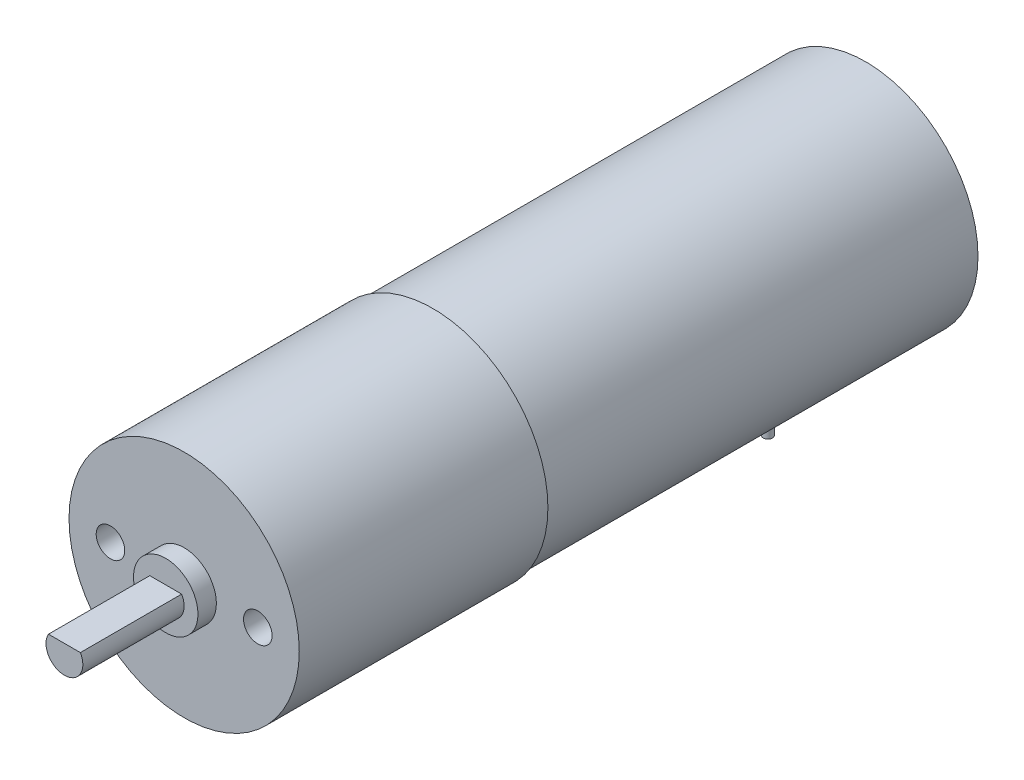
ISO-10303-21;
HEADER;
FILE_DESCRIPTION(('STEP AP214'),'2;1');
FILE_NAME('part.step','',(''),(''),'','','');
FILE_SCHEMA(('AUTOMOTIVE_DESIGN { 1 0 10303 214 1 1 1 1 }'));
ENDSEC;
DATA;
#1=APPLICATION_CONTEXT('core data for automotive mechanical design processes');
#2=APPLICATION_PROTOCOL_DEFINITION('international standard','automotive_design',2000,#1);
#3=PRODUCT_CONTEXT('',#1,'mechanical');
#4=PRODUCT('Part','Part','',(#3));
#5=PRODUCT_RELATED_PRODUCT_CATEGORY('part','',(#4));
#6=PRODUCT_DEFINITION_FORMATION('','',#4);
#7=PRODUCT_DEFINITION_CONTEXT('part definition',#1,'design');
#8=PRODUCT_DEFINITION('design','',#6,#7);
#9=PRODUCT_DEFINITION_SHAPE('','',#8);
#10=(LENGTH_UNIT() NAMED_UNIT(*) SI_UNIT(.MILLI.,.METRE.));
#11=(NAMED_UNIT(*) PLANE_ANGLE_UNIT() SI_UNIT($,.RADIAN.));
#12=(NAMED_UNIT(*) SI_UNIT($,.STERADIAN.) SOLID_ANGLE_UNIT());
#13=UNCERTAINTY_MEASURE_WITH_UNIT(LENGTH_MEASURE(1.E-05),#10,'distance_accuracy_value','');
#14=(GEOMETRIC_REPRESENTATION_CONTEXT(3) GLOBAL_UNCERTAINTY_ASSIGNED_CONTEXT((#13)) GLOBAL_UNIT_ASSIGNED_CONTEXT((#10,
#11,#12)) REPRESENTATION_CONTEXT('',''));
#15=CARTESIAN_POINT('',(0.,0.,0.));
#16=DIRECTION('',(0.,0.,1.));
#17=DIRECTION('',(1.,0.,0.));
#18=AXIS2_PLACEMENT_3D('',#15,#16,#17);
#19=CARTESIAN_POINT('',(-6.5,-15.,15.));
#20=DIRECTION('',(0.,0.,1.));
#21=DIRECTION('',(1.,0.,0.));
#22=AXIS2_PLACEMENT_3D('',#19,#20,#21);
#23=PLANE('',#22);
#24=DIRECTION('',(0.,1.,0.));
#25=VECTOR('',#24,1.);
#26=CARTESIAN_POINT('',(-6.5,-15.,15.));
#27=LINE('',#26,#25);
#28=CARTESIAN_POINT('',(-6.5,-10.3242433136768,15.));
#29=VERTEX_POINT('',#28);
#30=CARTESIAN_POINT('',(-6.5,0.,15.));
#31=VERTEX_POINT('',#30);
#32=EDGE_CURVE('E142',#29,#31,#27,.T.);
#33=ORIENTED_EDGE('',*,*,#32,.T.);
#34=DIRECTION('',(1.,0.,0.));
#35=VECTOR('',#34,1.);
#36=CARTESIAN_POINT('',(-6.5,0.,15.));
#37=LINE('',#36,#35);
#38=CARTESIAN_POINT('',(6.5,0.,15.));
#39=VERTEX_POINT('',#38);
#40=EDGE_CURVE('E137',#31,#39,#37,.T.);
#41=ORIENTED_EDGE('',*,*,#40,.T.);
#42=DIRECTION('',(0.,1.,0.));
#43=VECTOR('',#42,1.);
#44=CARTESIAN_POINT('',(6.5,-15.,15.));
#45=LINE('',#44,#43);
#46=CARTESIAN_POINT('',(6.49999999999999,-10.3242433136768,15.));
#47=VERTEX_POINT('',#46);
#48=EDGE_CURVE('E131',#47,#39,#45,.T.);
#49=ORIENTED_EDGE('',*,*,#48,.F.);
#50=CARTESIAN_POINT('',(0.,0.,15.));
#51=DIRECTION('',(0.,0.,1.));
#52=DIRECTION('',(1.,0.,0.));
#53=AXIS2_PLACEMENT_3D('',#50,#51,#52);
#54=CIRCLE('',#53,12.2);
#55=EDGE_CURVE('E134',#29,#47,#54,.T.);
#56=ORIENTED_EDGE('',*,*,#55,.F.);
#57=EDGE_LOOP('',(#33,#41,#49,#56));
#58=FACE_BOUND('',#57,.T.);
#59=DIRECTION('',(0.,-1.,0.));
#60=VECTOR('',#59,1.);
#61=CARTESIAN_POINT('',(-4.12758101808042,-15.,15.));
#62=LINE('',#61,#60);
#63=CARTESIAN_POINT('',(-4.12758101808042,-10.5,15.));
#64=VERTEX_POINT('',#63);
#65=CARTESIAN_POINT('',(-4.12758101808042,-7.5,15.));
#66=VERTEX_POINT('',#65);
#67=EDGE_CURVE('E75',#64,#66,#62,.F.);
#68=ORIENTED_EDGE('',*,*,#67,.F.);
#69=DIRECTION('',(-1.,0.,0.));
#70=VECTOR('',#69,1.);
#71=CARTESIAN_POINT('',(4.09114064073439,-10.5,15.));
#72=LINE('',#71,#70);
#73=CARTESIAN_POINT('',(4.3098622995492,-10.5,15.));
#74=VERTEX_POINT('',#73);
#75=EDGE_CURVE('E182',#74,#64,#72,.T.);
#76=ORIENTED_EDGE('',*,*,#75,.F.);
#77=DIRECTION('',(0.,1.,0.));
#78=VECTOR('',#77,1.);
#79=CARTESIAN_POINT('',(4.3098622995492,-15.,15.));
#80=LINE('',#79,#78);
#81=CARTESIAN_POINT('',(4.3098622995492,-7.5,15.));
#82=VERTEX_POINT('',#81);
#83=EDGE_CURVE('E67',#82,#74,#80,.F.);
#84=ORIENTED_EDGE('',*,*,#83,.F.);
#85=DIRECTION('',(1.,0.,0.));
#86=VECTOR('',#85,1.);
#87=CARTESIAN_POINT('',(4.09114064073439,-7.5,15.));
#88=LINE('',#87,#86);
#89=EDGE_CURVE('E61',#66,#82,#88,.T.);
#90=ORIENTED_EDGE('',*,*,#89,.F.);
#91=EDGE_LOOP('',(#68,#76,#84,#90));
#92=FACE_BOUND('',#91,.T.);
#93=ADVANCED_FACE('F44',(#58,#92),#23,.F.);
#94=CARTESIAN_POINT('',(0.,0.,47.));
#95=DIRECTION('',(0.,0.,-1.));
#96=DIRECTION('',(-1.,0.,0.));
#97=AXIS2_PLACEMENT_3D('',#94,#95,#96);
#98=CYLINDRICAL_SURFACE('',#97,12.2);
#99=CARTESIAN_POINT('',(0.,0.,10.));
#100=DIRECTION('',(0.,0.,-1.));
#101=DIRECTION('',(-1.,0.,0.));
#102=AXIS2_PLACEMENT_3D('',#99,#100,#101);
#103=CIRCLE('',#102,12.2);
#104=CARTESIAN_POINT('',(6.5,-10.3242433136768,10.));
#105=VERTEX_POINT('',#104);
#106=CARTESIAN_POINT('',(-6.5,-10.3242433136768,10.));
#107=VERTEX_POINT('',#106);
#108=EDGE_CURVE('E150',#105,#107,#103,.T.);
#109=ORIENTED_EDGE('',*,*,#108,.T.);
#110=DIRECTION('',(0.,0.,-1.));
#111=VECTOR('',#110,1.);
#112=CARTESIAN_POINT('',(-6.50000000000001,-10.3242433136768,47.));
#113=LINE('',#112,#111);
#114=EDGE_CURVE('E155',#107,#29,#113,.F.);
#115=ORIENTED_EDGE('',*,*,#114,.T.);
#116=ORIENTED_EDGE('',*,*,#55,.T.);
#117=DIRECTION('',(0.,0.,-1.));
#118=VECTOR('',#117,1.);
#119=CARTESIAN_POINT('',(6.49999999999999,-10.3242433136768,47.));
#120=LINE('',#119,#118);
#121=EDGE_CURVE('E146',#47,#105,#120,.T.);
#122=ORIENTED_EDGE('',*,*,#121,.T.);
#123=EDGE_LOOP('',(#109,#115,#116,#122));
#124=FACE_BOUND('',#123,.T.);
#125=CARTESIAN_POINT('',(0.,0.,47.));
#126=DIRECTION('',(0.,0.,1.));
#127=DIRECTION('',(1.,0.,0.));
#128=AXIS2_PLACEMENT_3D('',#125,#126,#127);
#129=CIRCLE('',#128,12.2);
#130=CARTESIAN_POINT('',(12.2,0.,47.));
#131=VERTEX_POINT('',#130);
#132=EDGE_CURVE('E159',#131,#131,#129,.T.);
#133=ORIENTED_EDGE('',*,*,#132,.F.);
#134=EDGE_LOOP('',(#133));
#135=FACE_BOUND('',#134,.T.);
#136=CARTESIAN_POINT('',(0.,0.,0.));
#137=DIRECTION('',(0.,0.,1.));
#138=DIRECTION('',(1.,0.,0.));
#139=AXIS2_PLACEMENT_3D('',#136,#137,#138);
#140=CIRCLE('',#139,12.2);
#141=CARTESIAN_POINT('',(12.2,0.,0.));
#142=VERTEX_POINT('',#141);
#143=EDGE_CURVE('E162',#142,#142,#140,.T.);
#144=ORIENTED_EDGE('',*,*,#143,.T.);
#145=EDGE_LOOP('',(#144));
#146=FACE_BOUND('',#145,.T.);
#147=ADVANCED_FACE('F153',(#124,#135,#146),#98,.T.);
#148=CARTESIAN_POINT('',(0.,0.,0.));
#149=DIRECTION('',(0.,0.,1.));
#150=DIRECTION('',(1.,0.,0.));
#151=AXIS2_PLACEMENT_3D('',#148,#149,#150);
#152=PLANE('',#151);
#153=ORIENTED_EDGE('',*,*,#143,.F.);
#154=EDGE_LOOP('',(#153));
#155=FACE_BOUND('',#154,.T.);
#156=ADVANCED_FACE('F248',(#155),#152,.F.);
#157=CARTESIAN_POINT('',(0.,0.,74.));
#158=DIRECTION('',(0.,0.,-1.));
#159=DIRECTION('',(-1.,0.,0.));
#160=AXIS2_PLACEMENT_3D('',#157,#158,#159);
#161=CYLINDRICAL_SURFACE('',#160,12.5);
#162=CARTESIAN_POINT('',(0.,0.,74.));
#163=DIRECTION('',(0.,0.,1.));
#164=DIRECTION('',(1.,0.,0.));
#165=AXIS2_PLACEMENT_3D('',#162,#163,#164);
#166=CIRCLE('',#165,12.5);
#167=CARTESIAN_POINT('',(12.5,0.,74.));
#168=VERTEX_POINT('',#167);
#169=EDGE_CURVE('E237',#168,#168,#166,.T.);
#170=ORIENTED_EDGE('',*,*,#169,.F.);
#171=EDGE_LOOP('',(#170));
#172=FACE_BOUND('',#171,.T.);
#173=CARTESIAN_POINT('',(0.,0.,47.));
#174=DIRECTION('',(0.,0.,1.));
#175=DIRECTION('',(1.,0.,0.));
#176=AXIS2_PLACEMENT_3D('',#173,#174,#175);
#177=CIRCLE('',#176,12.5);
#178=CARTESIAN_POINT('',(12.5,0.,47.));
#179=VERTEX_POINT('',#178);
#180=EDGE_CURVE('E235',#179,#179,#177,.T.);
#181=ORIENTED_EDGE('',*,*,#180,.T.);
#182=EDGE_LOOP('',(#181));
#183=FACE_BOUND('',#182,.T.);
#184=ADVANCED_FACE('F250',(#172,#183),#161,.T.);
#185=CARTESIAN_POINT('',(0.,0.,74.));
#186=DIRECTION('',(0.,0.,1.));
#187=DIRECTION('',(1.,0.,0.));
#188=AXIS2_PLACEMENT_3D('',#185,#186,#187);
#189=PLANE('',#188);
#190=CARTESIAN_POINT('',(-8.,0.,74.));
#191=DIRECTION('',(0.,0.,1.));
#192=DIRECTION('',(1.,0.,0.));
#193=AXIS2_PLACEMENT_3D('',#190,#191,#192);
#194=CIRCLE('',#193,1.55);
#195=CARTESIAN_POINT('',(-6.45,0.,74.));
#196=VERTEX_POINT('',#195);
#197=EDGE_CURVE('E566',#196,#196,#194,.T.);
#198=ORIENTED_EDGE('',*,*,#197,.F.);
#199=EDGE_LOOP('',(#198));
#200=FACE_BOUND('',#199,.T.);
#201=CARTESIAN_POINT('',(8.,0.,74.));
#202=DIRECTION('',(0.,0.,1.));
#203=DIRECTION('',(-1.,0.,0.));
#204=AXIS2_PLACEMENT_3D('',#201,#202,#203);
#205=CIRCLE('',#204,1.55);
#206=CARTESIAN_POINT('',(6.45,0.,74.));
#207=VERTEX_POINT('',#206);
#208=EDGE_CURVE('E563',#207,#207,#205,.T.);
#209=ORIENTED_EDGE('',*,*,#208,.F.);
#210=EDGE_LOOP('',(#209));
#211=FACE_BOUND('',#210,.T.);
#212=CARTESIAN_POINT('',(0.,0.,74.));
#213=DIRECTION('',(0.,0.,1.));
#214=DIRECTION('',(1.,0.,0.));
#215=AXIS2_PLACEMENT_3D('',#212,#213,#214);
#216=CIRCLE('',#215,3.5);
#217=CARTESIAN_POINT('',(3.5,0.,74.));
#218=VERTEX_POINT('',#217);
#219=EDGE_CURVE('E156',#218,#218,#216,.T.);
#220=ORIENTED_EDGE('',*,*,#219,.F.);
#221=EDGE_LOOP('',(#220));
#222=FACE_BOUND('',#221,.T.);
#223=ORIENTED_EDGE('',*,*,#169,.T.);
#224=EDGE_LOOP('',(#223));
#225=FACE_BOUND('',#224,.T.);
#226=ADVANCED_FACE('F255',(#200,#211,#222,#225),#189,.T.);
#227=CARTESIAN_POINT('',(0.,0.,47.));
#228=DIRECTION('',(0.,0.,1.));
#229=DIRECTION('',(1.,0.,0.));
#230=AXIS2_PLACEMENT_3D('',#227,#228,#229);
#231=PLANE('',#230);
#232=ORIENTED_EDGE('',*,*,#132,.T.);
#233=EDGE_LOOP('',(#232));
#234=FACE_BOUND('',#233,.T.);
#235=ORIENTED_EDGE('',*,*,#180,.F.);
#236=EDGE_LOOP('',(#235));
#237=FACE_BOUND('',#236,.T.);
#238=ADVANCED_FACE('F292',(#234,#237),#231,.F.);
#239=CARTESIAN_POINT('',(0.,0.,76.));
#240=DIRECTION('',(0.,0.,-1.));
#241=DIRECTION('',(-1.,0.,0.));
#242=AXIS2_PLACEMENT_3D('',#239,#240,#241);
#243=CYLINDRICAL_SURFACE('',#242,3.5);
#244=CARTESIAN_POINT('',(0.,0.,76.));
#245=DIRECTION('',(0.,0.,1.));
#246=DIRECTION('',(1.,0.,0.));
#247=AXIS2_PLACEMENT_3D('',#244,#245,#246);
#248=CIRCLE('',#247,3.5);
#249=CARTESIAN_POINT('',(3.5,0.,76.));
#250=VERTEX_POINT('',#249);
#251=EDGE_CURVE('E233',#250,#250,#248,.T.);
#252=ORIENTED_EDGE('',*,*,#251,.F.);
#253=EDGE_LOOP('',(#252));
#254=FACE_BOUND('',#253,.T.);
#255=ORIENTED_EDGE('',*,*,#219,.T.);
#256=EDGE_LOOP('',(#255));
#257=FACE_BOUND('',#256,.T.);
#258=ADVANCED_FACE('F289',(#254,#257),#243,.T.);
#259=CARTESIAN_POINT('',(0.,0.,76.));
#260=DIRECTION('',(0.,0.,1.));
#261=DIRECTION('',(1.,0.,0.));
#262=AXIS2_PLACEMENT_3D('',#259,#260,#261);
#263=PLANE('',#262);
#264=CARTESIAN_POINT('',(0.,0.,76.));
#265=DIRECTION('',(0.,0.,1.));
#266=DIRECTION('',(1.,0.,0.));
#267=AXIS2_PLACEMENT_3D('',#264,#265,#266);
#268=CIRCLE('',#267,2.);
#269=CARTESIAN_POINT('',(-1.73205080756888,1.,76.));
#270=VERTEX_POINT('',#269);
#271=CARTESIAN_POINT('',(1.73205080756888,1.,76.));
#272=VERTEX_POINT('',#271);
#273=EDGE_CURVE('E217',#270,#272,#268,.T.);
#274=ORIENTED_EDGE('',*,*,#273,.F.);
#275=DIRECTION('',(-1.,0.,0.));
#276=VECTOR('',#275,1.);
#277=CARTESIAN_POINT('',(-1.73205080756888,1.,76.));
#278=LINE('',#277,#276);
#279=EDGE_CURVE('E126',#272,#270,#278,.T.);
#280=ORIENTED_EDGE('',*,*,#279,.F.);
#281=EDGE_LOOP('',(#274,#280));
#282=FACE_BOUND('',#281,.T.);
#283=ORIENTED_EDGE('',*,*,#251,.T.);
#284=EDGE_LOOP('',(#283));
#285=FACE_BOUND('',#284,.T.);
#286=ADVANCED_FACE('F285',(#282,#285),#263,.T.);
#287=CARTESIAN_POINT('',(0.,0.,87.));
#288=DIRECTION('',(0.,0.,-1.));
#289=DIRECTION('',(-1.,0.,0.));
#290=AXIS2_PLACEMENT_3D('',#287,#288,#289);
#291=CYLINDRICAL_SURFACE('',#290,2.);
#292=ORIENTED_EDGE('',*,*,#273,.T.);
#293=DIRECTION('',(0.,0.,-1.));
#294=VECTOR('',#293,1.);
#295=CARTESIAN_POINT('',(1.73205080756888,1.,87.));
#296=LINE('',#295,#294);
#297=CARTESIAN_POINT('',(1.73205080756888,1.,87.));
#298=VERTEX_POINT('',#297);
#299=EDGE_CURVE('E231',#298,#272,#296,.T.);
#300=ORIENTED_EDGE('',*,*,#299,.F.);
#301=CARTESIAN_POINT('',(0.,0.,87.));
#302=DIRECTION('',(0.,0.,1.));
#303=DIRECTION('',(1.,0.,0.));
#304=AXIS2_PLACEMENT_3D('',#301,#302,#303);
#305=CIRCLE('',#304,2.);
#306=CARTESIAN_POINT('',(-1.73205080756888,1.,87.));
#307=VERTEX_POINT('',#306);
#308=EDGE_CURVE('E220',#307,#298,#305,.T.);
#309=ORIENTED_EDGE('',*,*,#308,.F.);
#310=DIRECTION('',(0.,0.,-1.));
#311=VECTOR('',#310,1.);
#312=CARTESIAN_POINT('',(-1.73205080756888,1.,87.));
#313=LINE('',#312,#311);
#314=EDGE_CURVE('E225',#307,#270,#313,.T.);
#315=ORIENTED_EDGE('',*,*,#314,.T.);
#316=EDGE_LOOP('',(#292,#300,#309,#315));
#317=FACE_BOUND('',#316,.T.);
#318=ADVANCED_FACE('F281',(#317),#291,.T.);
#319=CARTESIAN_POINT('',(-1.73205080756888,1.,87.));
#320=DIRECTION('',(0.,-1.,0.));
#321=DIRECTION('',(0.,0.,-1.));
#322=AXIS2_PLACEMENT_3D('',#319,#320,#321);
#323=PLANE('',#322);
#324=ORIENTED_EDGE('',*,*,#279,.T.);
#325=ORIENTED_EDGE('',*,*,#314,.F.);
#326=DIRECTION('',(-1.,0.,0.));
#327=VECTOR('',#326,1.);
#328=CARTESIAN_POINT('',(-1.73205080756888,1.,87.));
#329=LINE('',#328,#327);
#330=EDGE_CURVE('E223',#298,#307,#329,.T.);
#331=ORIENTED_EDGE('',*,*,#330,.F.);
#332=ORIENTED_EDGE('',*,*,#299,.T.);
#333=EDGE_LOOP('',(#324,#325,#331,#332));
#334=FACE_BOUND('',#333,.T.);
#335=ADVANCED_FACE('F277',(#334),#323,.F.);
#336=CARTESIAN_POINT('',(0.,0.,87.));
#337=DIRECTION('',(0.,0.,1.));
#338=DIRECTION('',(1.,0.,0.));
#339=AXIS2_PLACEMENT_3D('',#336,#337,#338);
#340=PLANE('',#339);
#341=ORIENTED_EDGE('',*,*,#308,.T.);
#342=ORIENTED_EDGE('',*,*,#330,.T.);
#343=EDGE_LOOP('',(#341,#342));
#344=FACE_BOUND('',#343,.T.);
#345=ADVANCED_FACE('F273',(#344),#340,.T.);
#346=CARTESIAN_POINT('',(-6.5,-15.,15.));
#347=DIRECTION('',(-1.,0.,0.));
#348=DIRECTION('',(0.,0.,1.));
#349=AXIS2_PLACEMENT_3D('',#346,#347,#348);
#350=PLANE('',#349);
#351=DIRECTION('',(0.,1.,0.));
#352=VECTOR('',#351,1.);
#353=CARTESIAN_POINT('',(-6.5,-15.,10.));
#354=LINE('',#353,#352);
#355=CARTESIAN_POINT('',(-6.5,0.,10.));
#356=VERTEX_POINT('',#355);
#357=EDGE_CURVE('E215',#107,#356,#354,.T.);
#358=ORIENTED_EDGE('',*,*,#357,.T.);
#359=DIRECTION('',(0.,0.,1.));
#360=VECTOR('',#359,1.);
#361=CARTESIAN_POINT('',(-6.5,0.,15.));
#362=LINE('',#361,#360);
#363=EDGE_CURVE('E206',#356,#31,#362,.T.);
#364=ORIENTED_EDGE('',*,*,#363,.T.);
#365=ORIENTED_EDGE('',*,*,#32,.F.);
#366=ORIENTED_EDGE('',*,*,#114,.F.);
#367=EDGE_LOOP('',(#358,#364,#365,#366));
#368=FACE_BOUND('',#367,.T.);
#369=ADVANCED_FACE('F269',(#368),#350,.F.);
#370=CARTESIAN_POINT('',(-6.5,-15.,10.));
#371=DIRECTION('',(0.,0.,-1.));
#372=DIRECTION('',(-1.,0.,0.));
#373=AXIS2_PLACEMENT_3D('',#370,#371,#372);
#374=PLANE('',#373);
#375=DIRECTION('',(0.,1.,0.));
#376=VECTOR('',#375,1.);
#377=CARTESIAN_POINT('',(6.5,-15.,10.));
#378=LINE('',#377,#376);
#379=CARTESIAN_POINT('',(6.5,0.,10.));
#380=VERTEX_POINT('',#379);
#381=EDGE_CURVE('E141',#105,#380,#378,.T.);
#382=ORIENTED_EDGE('',*,*,#381,.T.);
#383=DIRECTION('',(-1.,0.,0.));
#384=VECTOR('',#383,1.);
#385=CARTESIAN_POINT('',(-6.5,0.,10.));
#386=LINE('',#385,#384);
#387=EDGE_CURVE('E212',#380,#356,#386,.T.);
#388=ORIENTED_EDGE('',*,*,#387,.T.);
#389=ORIENTED_EDGE('',*,*,#357,.F.);
#390=ORIENTED_EDGE('',*,*,#108,.F.);
#391=EDGE_LOOP('',(#382,#388,#389,#390));
#392=FACE_BOUND('',#391,.T.);
#393=ADVANCED_FACE('F272',(#392),#374,.F.);
#394=CARTESIAN_POINT('',(6.5,-15.,15.));
#395=DIRECTION('',(1.,0.,0.));
#396=DIRECTION('',(0.,0.,-1.));
#397=AXIS2_PLACEMENT_3D('',#394,#395,#396);
#398=PLANE('',#397);
#399=ORIENTED_EDGE('',*,*,#48,.T.);
#400=DIRECTION('',(0.,0.,-1.));
#401=VECTOR('',#400,1.);
#402=CARTESIAN_POINT('',(6.5,0.,15.));
#403=LINE('',#402,#401);
#404=EDGE_CURVE('E210',#39,#380,#403,.T.);
#405=ORIENTED_EDGE('',*,*,#404,.T.);
#406=ORIENTED_EDGE('',*,*,#381,.F.);
#407=ORIENTED_EDGE('',*,*,#121,.F.);
#408=EDGE_LOOP('',(#399,#405,#406,#407));
#409=FACE_BOUND('',#408,.T.);
#410=ADVANCED_FACE('F147',(#409),#398,.F.);
#411=CARTESIAN_POINT('',(0.,0.,0.));
#412=DIRECTION('',(0.,-1.,0.));
#413=DIRECTION('',(0.,0.,-1.));
#414=AXIS2_PLACEMENT_3D('',#411,#412,#413);
#415=PLANE('',#414);
#416=ORIENTED_EDGE('',*,*,#363,.F.);
#417=ORIENTED_EDGE('',*,*,#387,.F.);
#418=ORIENTED_EDGE('',*,*,#404,.F.);
#419=ORIENTED_EDGE('',*,*,#40,.F.);
#420=EDGE_LOOP('',(#416,#417,#418,#419));
#421=FACE_BOUND('',#420,.T.);
#422=ADVANCED_FACE('F355',(#421),#415,.T.);
#423=CARTESIAN_POINT('',(-3.90885935926561,-10.5,12.5));
#424=DIRECTION('',(-0.996194698091746,0.,-0.0871557427476584));
#425=DIRECTION('',(-0.0871557427476584,0.,0.996194698091746));
#426=AXIS2_PLACEMENT_3D('',#423,#424,#425);
#427=PLANE('',#426);
#428=ORIENTED_EDGE('',*,*,#67,.T.);
#429=DIRECTION('',(0.0871557427476584,0.,-0.996194698091746));
#430=VECTOR('',#429,1.);
#431=CARTESIAN_POINT('',(-3.84809037131444,-7.5,11.8054072893323));
#432=LINE('',#431,#430);
#433=CARTESIAN_POINT('',(-3.90885935926561,-7.5,12.5));
#434=VERTEX_POINT('',#433);
#435=EDGE_CURVE('E48',#434,#66,#432,.F.);
#436=ORIENTED_EDGE('',*,*,#435,.F.);
#437=DIRECTION('',(0.,1.,0.));
#438=VECTOR('',#437,1.);
#439=CARTESIAN_POINT('',(-3.90885935926561,-10.5,12.5));
#440=LINE('',#439,#438);
#441=CARTESIAN_POINT('',(-3.90885935926561,-10.5,12.5));
#442=VERTEX_POINT('',#441);
#443=EDGE_CURVE('E205',#442,#434,#440,.T.);
#444=ORIENTED_EDGE('',*,*,#443,.F.);
#445=DIRECTION('',(0.0871557427476584,0.,-0.996194698091746));
#446=VECTOR('',#445,1.);
#447=CARTESIAN_POINT('',(-3.90885935926561,-10.5,12.5));
#448=LINE('',#447,#446);
#449=EDGE_CURVE('E189',#442,#64,#448,.F.);
#450=ORIENTED_EDGE('',*,*,#449,.T.);
#451=EDGE_LOOP('',(#428,#436,#444,#450));
#452=FACE_BOUND('',#451,.T.);
#453=ADVANCED_FACE('F46',(#452),#427,.T.);
#454=CARTESIAN_POINT('',(4.09114064073439,-7.5,12.5));
#455=DIRECTION('',(0.,-1.,0.));
#456=DIRECTION('',(1.,0.,0.));
#457=AXIS2_PLACEMENT_3D('',#454,#455,#456);
#458=PLANE('',#457);
#459=ORIENTED_EDGE('',*,*,#89,.T.);
#460=DIRECTION('',(-0.0871557427476584,0.,-0.996194698091746));
#461=VECTOR('',#460,1.);
#462=CARTESIAN_POINT('',(4.09114064073439,-7.5,12.5));
#463=LINE('',#462,#461);
#464=CARTESIAN_POINT('',(4.09114064073439,-7.5,12.5));
#465=VERTEX_POINT('',#464);
#466=EDGE_CURVE('E183',#465,#82,#463,.F.);
#467=ORIENTED_EDGE('',*,*,#466,.F.);
#468=DIRECTION('',(1.,0.,0.));
#469=VECTOR('',#468,1.);
#470=CARTESIAN_POINT('',(4.09114064073439,-7.5,12.5));
#471=LINE('',#470,#469);
#472=EDGE_CURVE('E83',#434,#465,#471,.T.);
#473=ORIENTED_EDGE('',*,*,#472,.F.);
#474=ORIENTED_EDGE('',*,*,#435,.T.);
#475=EDGE_LOOP('',(#459,#467,#473,#474));
#476=FACE_BOUND('',#475,.T.);
#477=ADVANCED_FACE('F531',(#476),#458,.F.);
#478=CARTESIAN_POINT('',(4.09114064073439,-10.5,12.5));
#479=DIRECTION('',(0.996194698091746,0.,-0.0871557427476584));
#480=DIRECTION('',(-0.0871557427476584,0.,-0.996194698091746));
#481=AXIS2_PLACEMENT_3D('',#478,#479,#480);
#482=PLANE('',#481);
#483=ORIENTED_EDGE('',*,*,#83,.T.);
#484=DIRECTION('',(-0.0871557427476584,0.,-0.996194698091746));
#485=VECTOR('',#484,1.);
#486=CARTESIAN_POINT('',(4.09114064073439,-10.5,12.5));
#487=LINE('',#486,#485);
#488=CARTESIAN_POINT('',(4.09114064073439,-10.5,12.5));
#489=VERTEX_POINT('',#488);
#490=EDGE_CURVE('E186',#489,#74,#487,.F.);
#491=ORIENTED_EDGE('',*,*,#490,.F.);
#492=DIRECTION('',(0.,-1.,0.));
#493=VECTOR('',#492,1.);
#494=CARTESIAN_POINT('',(4.09114064073439,-10.5,12.5));
#495=LINE('',#494,#493);
#496=EDGE_CURVE('E196',#465,#489,#495,.T.);
#497=ORIENTED_EDGE('',*,*,#496,.F.);
#498=ORIENTED_EDGE('',*,*,#466,.T.);
#499=EDGE_LOOP('',(#483,#491,#497,#498));
#500=FACE_BOUND('',#499,.T.);
#501=ADVANCED_FACE('F529',(#500),#482,.T.);
#502=CARTESIAN_POINT('',(4.09114064073439,-10.5,12.5));
#503=DIRECTION('',(0.,1.,0.));
#504=DIRECTION('',(0.,0.,1.));
#505=AXIS2_PLACEMENT_3D('',#502,#503,#504);
#506=PLANE('',#505);
#507=CARTESIAN_POINT('',(3.13671046240396,-10.5,13.75));
#508=DIRECTION('',(0.,1.,0.));
#509=DIRECTION('',(0.,0.,1.));
#510=AXIS2_PLACEMENT_3D('',#507,#508,#509);
#511=CIRCLE('',#510,0.5);
#512=CARTESIAN_POINT('',(3.13671046240396,-10.5,14.25));
#513=VERTEX_POINT('',#512);
#514=EDGE_CURVE('E11',#513,#513,#511,.F.);
#515=ORIENTED_EDGE('',*,*,#514,.F.);
#516=EDGE_LOOP('',(#515));
#517=FACE_BOUND('',#516,.T.);
#518=CARTESIAN_POINT('',(1.93671046240396,-10.5,13.75));
#519=DIRECTION('',(0.,1.,0.));
#520=DIRECTION('',(0.,0.,1.));
#521=AXIS2_PLACEMENT_3D('',#518,#519,#520);
#522=CIRCLE('',#521,0.5);
#523=CARTESIAN_POINT('',(1.93671046240396,-10.5,14.25));
#524=VERTEX_POINT('',#523);
#525=EDGE_CURVE('E53',#524,#524,#522,.F.);
#526=ORIENTED_EDGE('',*,*,#525,.F.);
#527=EDGE_LOOP('',(#526));
#528=FACE_BOUND('',#527,.T.);
#529=CARTESIAN_POINT('',(0.736710462403958,-10.5,13.75));
#530=DIRECTION('',(0.,1.,0.));
#531=DIRECTION('',(0.,0.,1.));
#532=AXIS2_PLACEMENT_3D('',#529,#530,#531);
#533=CIRCLE('',#532,0.5);
#534=CARTESIAN_POINT('',(0.736710462403958,-10.5,14.25));
#535=VERTEX_POINT('',#534);
#536=EDGE_CURVE('E176',#535,#535,#533,.F.);
#537=ORIENTED_EDGE('',*,*,#536,.F.);
#538=EDGE_LOOP('',(#537));
#539=FACE_BOUND('',#538,.T.);
#540=CARTESIAN_POINT('',(-0.463289537596042,-10.5,13.75));
#541=DIRECTION('',(0.,1.,0.));
#542=DIRECTION('',(0.,0.,1.));
#543=AXIS2_PLACEMENT_3D('',#540,#541,#542);
#544=CIRCLE('',#543,0.5);
#545=CARTESIAN_POINT('',(-0.463289537596042,-10.5,14.25));
#546=VERTEX_POINT('',#545);
#547=EDGE_CURVE('E173',#546,#546,#544,.F.);
#548=ORIENTED_EDGE('',*,*,#547,.F.);
#549=EDGE_LOOP('',(#548));
#550=FACE_BOUND('',#549,.T.);
#551=CARTESIAN_POINT('',(-1.66328953759604,-10.5,13.75));
#552=DIRECTION('',(0.,1.,0.));
#553=DIRECTION('',(0.,0.,1.));
#554=AXIS2_PLACEMENT_3D('',#551,#552,#553);
#555=CIRCLE('',#554,0.5);
#556=CARTESIAN_POINT('',(-1.66328953759604,-10.5,14.25));
#557=VERTEX_POINT('',#556);
#558=EDGE_CURVE('E170',#557,#557,#555,.F.);
#559=ORIENTED_EDGE('',*,*,#558,.F.);
#560=EDGE_LOOP('',(#559));
#561=FACE_BOUND('',#560,.T.);
#562=CARTESIAN_POINT('',(-2.86328953759604,-10.5,13.75));
#563=DIRECTION('',(0.,1.,0.));
#564=DIRECTION('',(0.,0.,1.));
#565=AXIS2_PLACEMENT_3D('',#562,#563,#564);
#566=CIRCLE('',#565,0.5);
#567=CARTESIAN_POINT('',(-2.86328953759604,-10.5,14.25));
#568=VERTEX_POINT('',#567);
#569=EDGE_CURVE('E167',#568,#568,#566,.F.);
#570=ORIENTED_EDGE('',*,*,#569,.F.);
#571=EDGE_LOOP('',(#570));
#572=FACE_BOUND('',#571,.T.);
#573=ORIENTED_EDGE('',*,*,#75,.T.);
#574=ORIENTED_EDGE('',*,*,#449,.F.);
#575=DIRECTION('',(-1.,0.,0.));
#576=VECTOR('',#575,1.);
#577=CARTESIAN_POINT('',(4.09114064073439,-10.5,12.5));
#578=LINE('',#577,#576);
#579=EDGE_CURVE('E192',#489,#442,#578,.T.);
#580=ORIENTED_EDGE('',*,*,#579,.F.);
#581=ORIENTED_EDGE('',*,*,#490,.T.);
#582=EDGE_LOOP('',(#573,#574,#580,#581));
#583=FACE_BOUND('',#582,.T.);
#584=ADVANCED_FACE('F373',(#517,#528,#539,#550,#561,#572,#583),#506,.F.);
#585=CARTESIAN_POINT('',(0.,0.,12.5));
#586=DIRECTION('',(0.,0.,1.));
#587=DIRECTION('',(1.,0.,0.));
#588=AXIS2_PLACEMENT_3D('',#585,#586,#587);
#589=PLANE('',#588);
#590=ORIENTED_EDGE('',*,*,#443,.T.);
#591=ORIENTED_EDGE('',*,*,#472,.T.);
#592=ORIENTED_EDGE('',*,*,#496,.T.);
#593=ORIENTED_EDGE('',*,*,#579,.T.);
#594=EDGE_LOOP('',(#590,#591,#592,#593));
#595=FACE_BOUND('',#594,.T.);
#596=ADVANCED_FACE('F368',(#595),#589,.F.);
#597=CARTESIAN_POINT('',(-2.86328953759604,-14.5,13.75));
#598=DIRECTION('',(0.,1.,0.));
#599=DIRECTION('',(0.,0.,1.));
#600=AXIS2_PLACEMENT_3D('',#597,#598,#599);
#601=CYLINDRICAL_SURFACE('',#600,0.5);
#602=CARTESIAN_POINT('',(-2.86328953759604,-14.5,13.75));
#603=DIRECTION('',(0.,-1.,0.));
#604=DIRECTION('',(0.,0.,-1.));
#605=AXIS2_PLACEMENT_3D('',#602,#603,#604);
#606=CIRCLE('',#605,0.5);
#607=CARTESIAN_POINT('',(-2.86328953759604,-14.5,13.25));
#608=VERTEX_POINT('',#607);
#609=EDGE_CURVE('E190',#608,#608,#606,.T.);
#610=ORIENTED_EDGE('',*,*,#609,.F.);
#611=EDGE_LOOP('',(#610));
#612=FACE_BOUND('',#611,.T.);
#613=ORIENTED_EDGE('',*,*,#569,.T.);
#614=EDGE_LOOP('',(#613));
#615=FACE_BOUND('',#614,.T.);
#616=ADVANCED_FACE('F372',(#612,#615),#601,.T.);
#617=CARTESIAN_POINT('',(-2.86328953759604,-14.5,13.75));
#618=DIRECTION('',(0.,-1.,0.));
#619=DIRECTION('',(0.,0.,-1.));
#620=AXIS2_PLACEMENT_3D('',#617,#618,#619);
#621=PLANE('',#620);
#622=ORIENTED_EDGE('',*,*,#609,.T.);
#623=EDGE_LOOP('',(#622));
#624=FACE_BOUND('',#623,.T.);
#625=ADVANCED_FACE('F382',(#624),#621,.T.);
#626=CARTESIAN_POINT('',(-1.66328953759604,-14.5,13.75));
#627=DIRECTION('',(0.,1.,0.));
#628=DIRECTION('',(0.,0.,1.));
#629=AXIS2_PLACEMENT_3D('',#626,#627,#628);
#630=CYLINDRICAL_SURFACE('',#629,0.5);
#631=CARTESIAN_POINT('',(-1.66328953759604,-14.5,13.75));
#632=DIRECTION('',(0.,-1.,0.));
#633=DIRECTION('',(0.,0.,-1.));
#634=AXIS2_PLACEMENT_3D('',#631,#632,#633);
#635=CIRCLE('',#634,0.5);
#636=CARTESIAN_POINT('',(-1.66328953759604,-14.5,13.25));
#637=VERTEX_POINT('',#636);
#638=EDGE_CURVE('E544',#637,#637,#635,.T.);
#639=ORIENTED_EDGE('',*,*,#638,.F.);
#640=EDGE_LOOP('',(#639));
#641=FACE_BOUND('',#640,.T.);
#642=ORIENTED_EDGE('',*,*,#558,.T.);
#643=EDGE_LOOP('',(#642));
#644=FACE_BOUND('',#643,.T.);
#645=ADVANCED_FACE('F391',(#641,#644),#630,.T.);
#646=CARTESIAN_POINT('',(-1.66328953759604,-14.5,13.75));
#647=DIRECTION('',(0.,-1.,0.));
#648=DIRECTION('',(0.,0.,-1.));
#649=AXIS2_PLACEMENT_3D('',#646,#647,#648);
#650=PLANE('',#649);
#651=ORIENTED_EDGE('',*,*,#638,.T.);
#652=EDGE_LOOP('',(#651));
#653=FACE_BOUND('',#652,.T.);
#654=ADVANCED_FACE('F400',(#653),#650,.T.);
#655=CARTESIAN_POINT('',(-0.463289537596042,-14.5,13.75));
#656=DIRECTION('',(0.,1.,0.));
#657=DIRECTION('',(0.,0.,1.));
#658=AXIS2_PLACEMENT_3D('',#655,#656,#657);
#659=CYLINDRICAL_SURFACE('',#658,0.5);
#660=CARTESIAN_POINT('',(-0.463289537596042,-14.5,13.75));
#661=DIRECTION('',(0.,-1.,0.));
#662=DIRECTION('',(0.,0.,-1.));
#663=AXIS2_PLACEMENT_3D('',#660,#661,#662);
#664=CIRCLE('',#663,0.5);
#665=CARTESIAN_POINT('',(-0.463289537596042,-14.5,13.25));
#666=VERTEX_POINT('',#665);
#667=EDGE_CURVE('E547',#666,#666,#664,.T.);
#668=ORIENTED_EDGE('',*,*,#667,.F.);
#669=EDGE_LOOP('',(#668));
#670=FACE_BOUND('',#669,.T.);
#671=ORIENTED_EDGE('',*,*,#547,.T.);
#672=EDGE_LOOP('',(#671));
#673=FACE_BOUND('',#672,.T.);
#674=ADVANCED_FACE('F409',(#670,#673),#659,.T.);
#675=CARTESIAN_POINT('',(-0.463289537596042,-14.5,13.75));
#676=DIRECTION('',(0.,-1.,0.));
#677=DIRECTION('',(0.,0.,-1.));
#678=AXIS2_PLACEMENT_3D('',#675,#676,#677);
#679=PLANE('',#678);
#680=ORIENTED_EDGE('',*,*,#667,.T.);
#681=EDGE_LOOP('',(#680));
#682=FACE_BOUND('',#681,.T.);
#683=ADVANCED_FACE('F418',(#682),#679,.T.);
#684=CARTESIAN_POINT('',(0.736710462403958,-14.5,13.75));
#685=DIRECTION('',(0.,1.,0.));
#686=DIRECTION('',(0.,0.,1.));
#687=AXIS2_PLACEMENT_3D('',#684,#685,#686);
#688=CYLINDRICAL_SURFACE('',#687,0.5);
#689=CARTESIAN_POINT('',(0.736710462403958,-14.5,13.75));
#690=DIRECTION('',(0.,-1.,0.));
#691=DIRECTION('',(0.,0.,-1.));
#692=AXIS2_PLACEMENT_3D('',#689,#690,#691);
#693=CIRCLE('',#692,0.5);
#694=CARTESIAN_POINT('',(0.736710462403958,-14.5,13.25));
#695=VERTEX_POINT('',#694);
#696=EDGE_CURVE('E550',#695,#695,#693,.T.);
#697=ORIENTED_EDGE('',*,*,#696,.F.);
#698=EDGE_LOOP('',(#697));
#699=FACE_BOUND('',#698,.T.);
#700=ORIENTED_EDGE('',*,*,#536,.T.);
#701=EDGE_LOOP('',(#700));
#702=FACE_BOUND('',#701,.T.);
#703=ADVANCED_FACE('F427',(#699,#702),#688,.T.);
#704=CARTESIAN_POINT('',(0.736710462403958,-14.5,13.75));
#705=DIRECTION('',(0.,-1.,0.));
#706=DIRECTION('',(0.,0.,-1.));
#707=AXIS2_PLACEMENT_3D('',#704,#705,#706);
#708=PLANE('',#707);
#709=ORIENTED_EDGE('',*,*,#696,.T.);
#710=EDGE_LOOP('',(#709));
#711=FACE_BOUND('',#710,.T.);
#712=ADVANCED_FACE('F436',(#711),#708,.T.);
#713=CARTESIAN_POINT('',(1.93671046240396,-14.5,13.75));
#714=DIRECTION('',(0.,1.,0.));
#715=DIRECTION('',(0.,0.,1.));
#716=AXIS2_PLACEMENT_3D('',#713,#714,#715);
#717=CYLINDRICAL_SURFACE('',#716,0.5);
#718=CARTESIAN_POINT('',(1.93671046240396,-14.5,13.75));
#719=DIRECTION('',(0.,-1.,0.));
#720=DIRECTION('',(0.,0.,-1.));
#721=AXIS2_PLACEMENT_3D('',#718,#719,#720);
#722=CIRCLE('',#721,0.5);
#723=CARTESIAN_POINT('',(1.93671046240396,-14.5,13.25));
#724=VERTEX_POINT('',#723);
#725=EDGE_CURVE('E553',#724,#724,#722,.T.);
#726=ORIENTED_EDGE('',*,*,#725,.F.);
#727=EDGE_LOOP('',(#726));
#728=FACE_BOUND('',#727,.T.);
#729=ORIENTED_EDGE('',*,*,#525,.T.);
#730=EDGE_LOOP('',(#729));
#731=FACE_BOUND('',#730,.T.);
#732=ADVANCED_FACE('F445',(#728,#731),#717,.T.);
#733=CARTESIAN_POINT('',(1.93671046240396,-14.5,13.75));
#734=DIRECTION('',(0.,-1.,0.));
#735=DIRECTION('',(0.,0.,-1.));
#736=AXIS2_PLACEMENT_3D('',#733,#734,#735);
#737=PLANE('',#736);
#738=ORIENTED_EDGE('',*,*,#725,.T.);
#739=EDGE_LOOP('',(#738));
#740=FACE_BOUND('',#739,.T.);
#741=ADVANCED_FACE('F454',(#740),#737,.T.);
#742=CARTESIAN_POINT('',(3.13671046240396,-14.5,13.75));
#743=DIRECTION('',(0.,1.,0.));
#744=DIRECTION('',(0.,0.,1.));
#745=AXIS2_PLACEMENT_3D('',#742,#743,#744);
#746=CYLINDRICAL_SURFACE('',#745,0.5);
#747=CARTESIAN_POINT('',(3.13671046240396,-14.5,13.75));
#748=DIRECTION('',(0.,-1.,0.));
#749=DIRECTION('',(0.,0.,-1.));
#750=AXIS2_PLACEMENT_3D('',#747,#748,#749);
#751=CIRCLE('',#750,0.5);
#752=CARTESIAN_POINT('',(3.13671046240396,-14.5,13.25));
#753=VERTEX_POINT('',#752);
#754=EDGE_CURVE('E556',#753,#753,#751,.T.);
#755=ORIENTED_EDGE('',*,*,#754,.F.);
#756=EDGE_LOOP('',(#755));
#757=FACE_BOUND('',#756,.T.);
#758=ORIENTED_EDGE('',*,*,#514,.T.);
#759=EDGE_LOOP('',(#758));
#760=FACE_BOUND('',#759,.T.);
#761=ADVANCED_FACE('F463',(#757,#760),#746,.T.);
#762=CARTESIAN_POINT('',(3.13671046240396,-14.5,13.75));
#763=DIRECTION('',(0.,-1.,0.));
#764=DIRECTION('',(0.,0.,-1.));
#765=AXIS2_PLACEMENT_3D('',#762,#763,#764);
#766=PLANE('',#765);
#767=ORIENTED_EDGE('',*,*,#754,.T.);
#768=EDGE_LOOP('',(#767));
#769=FACE_BOUND('',#768,.T.);
#770=ADVANCED_FACE('F471',(#769),#766,.T.);
#771=CARTESIAN_POINT('',(8.,0.,70.));
#772=DIRECTION('',(0.,0.,1.));
#773=DIRECTION('',(1.,0.,0.));
#774=AXIS2_PLACEMENT_3D('',#771,#772,#773);
#775=CYLINDRICAL_SURFACE('',#774,1.55);
#776=CARTESIAN_POINT('',(8.,0.,70.));
#777=DIRECTION('',(0.,0.,1.));
#778=DIRECTION('',(-1.,0.,0.));
#779=AXIS2_PLACEMENT_3D('',#776,#777,#778);
#780=CIRCLE('',#779,1.55);
#781=CARTESIAN_POINT('',(6.45,0.,70.));
#782=VERTEX_POINT('',#781);
#783=EDGE_CURVE('E560',#782,#782,#780,.T.);
#784=ORIENTED_EDGE('',*,*,#783,.F.);
#785=EDGE_LOOP('',(#784));
#786=FACE_BOUND('',#785,.T.);
#787=ORIENTED_EDGE('',*,*,#208,.T.);
#788=EDGE_LOOP('',(#787));
#789=FACE_BOUND('',#788,.T.);
#790=ADVANCED_FACE('F479',(#786,#789),#775,.F.);
#791=CARTESIAN_POINT('',(8.,0.,70.));
#792=DIRECTION('',(0.,0.,-1.));
#793=DIRECTION('',(-1.,0.,0.));
#794=AXIS2_PLACEMENT_3D('',#791,#792,#793);
#795=PLANE('',#794);
#796=ORIENTED_EDGE('',*,*,#783,.T.);
#797=EDGE_LOOP('',(#796));
#798=FACE_BOUND('',#797,.T.);
#799=ADVANCED_FACE('F492',(#798),#795,.F.);
#800=CARTESIAN_POINT('',(-8.,0.,70.));
#801=DIRECTION('',(0.,0.,1.));
#802=DIRECTION('',(1.,0.,0.));
#803=AXIS2_PLACEMENT_3D('',#800,#801,#802);
#804=CYLINDRICAL_SURFACE('',#803,1.55);
#805=CARTESIAN_POINT('',(-8.,0.,70.));
#806=DIRECTION('',(0.,0.,1.));
#807=DIRECTION('',(1.,0.,0.));
#808=AXIS2_PLACEMENT_3D('',#805,#806,#807);
#809=CIRCLE('',#808,1.55);
#810=CARTESIAN_POINT('',(-6.45,0.,70.));
#811=VERTEX_POINT('',#810);
#812=EDGE_CURVE('E559',#811,#811,#809,.T.);
#813=ORIENTED_EDGE('',*,*,#812,.F.);
#814=EDGE_LOOP('',(#813));
#815=FACE_BOUND('',#814,.T.);
#816=ORIENTED_EDGE('',*,*,#197,.T.);
#817=EDGE_LOOP('',(#816));
#818=FACE_BOUND('',#817,.T.);
#819=ADVANCED_FACE('F502',(#815,#818),#804,.F.);
#820=CARTESIAN_POINT('',(-8.,0.,70.));
#821=DIRECTION('',(0.,0.,1.));
#822=DIRECTION('',(1.,0.,0.));
#823=AXIS2_PLACEMENT_3D('',#820,#821,#822);
#824=PLANE('',#823);
#825=ORIENTED_EDGE('',*,*,#812,.T.);
#826=EDGE_LOOP('',(#825));
#827=FACE_BOUND('',#826,.T.);
#828=ADVANCED_FACE('F512',(#827),#824,.T.);
#829=CLOSED_SHELL('',(#93,#147,#156,#184,#226,#238,#258,#286,#318,#335,#345,#369,#393,#410,#422,
#453,#477,#501,#584,#596,#616,#625,#645,#654,#674,#683,#703,#712,#732,#741,#761,#770,#790,#799,
#819,#828));
#830=MANIFOLD_SOLID_BREP('B2',#829);
#831=ADVANCED_BREP_SHAPE_REPRESENTATION('',(#18,#830),#14);
#832=SHAPE_DEFINITION_REPRESENTATION(#9,#831);
ENDSEC;
END-ISO-10303-21;
